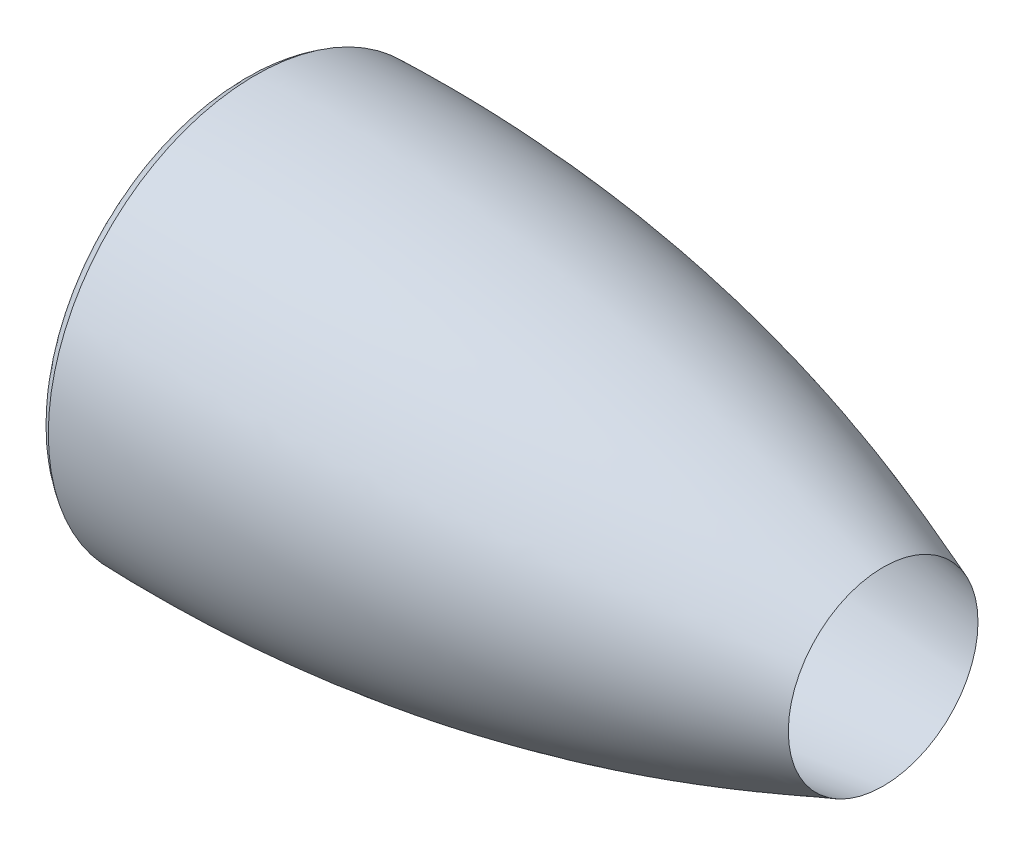
ISO-10303-21;
HEADER;
FILE_DESCRIPTION(('STEP AP214'),'2;1');
FILE_NAME('part.step','',(''),(''),'','','');
FILE_SCHEMA(('AUTOMOTIVE_DESIGN { 1 0 10303 214 1 1 1 1 }'));
ENDSEC;
DATA;
#1=APPLICATION_CONTEXT('core data for automotive mechanical design processes');
#2=APPLICATION_PROTOCOL_DEFINITION('international standard','automotive_design',2000,#1);
#3=PRODUCT_CONTEXT('',#1,'mechanical');
#4=PRODUCT('Part','Part','',(#3));
#5=PRODUCT_RELATED_PRODUCT_CATEGORY('part','',(#4));
#6=PRODUCT_DEFINITION_FORMATION('','',#4);
#7=PRODUCT_DEFINITION_CONTEXT('part definition',#1,'design');
#8=PRODUCT_DEFINITION('design','',#6,#7);
#9=PRODUCT_DEFINITION_SHAPE('','',#8);
#10=(LENGTH_UNIT() NAMED_UNIT(*) SI_UNIT(.MILLI.,.METRE.));
#11=(NAMED_UNIT(*) PLANE_ANGLE_UNIT() SI_UNIT($,.RADIAN.));
#12=(NAMED_UNIT(*) SI_UNIT($,.STERADIAN.) SOLID_ANGLE_UNIT());
#13=UNCERTAINTY_MEASURE_WITH_UNIT(LENGTH_MEASURE(1.E-05),#10,'distance_accuracy_value','');
#14=(GEOMETRIC_REPRESENTATION_CONTEXT(3) GLOBAL_UNCERTAINTY_ASSIGNED_CONTEXT((#13)) GLOBAL_UNIT_ASSIGNED_CONTEXT((#10,
#11,#12)) REPRESENTATION_CONTEXT('',''));
#15=CARTESIAN_POINT('',(0.,0.,0.));
#16=DIRECTION('',(0.,0.,1.));
#17=DIRECTION('',(1.,0.,0.));
#18=AXIS2_PLACEMENT_3D('',#15,#16,#17);
#19=CARTESIAN_POINT('',(-1.4699652629248,208.05036447345,0.));
#20=CARTESIAN_POINT('',(-2.27915844085005,207.555283103111,0.));
#21=CARTESIAN_POINT('',(-3.09149949924152,207.064026607034,0.));
#22=CARTESIAN_POINT('',(-4.68113892600378,206.038934525687,0.));
#23=CARTESIAN_POINT('',(-5.46173553687604,205.509106514081,0.));
#24=CARTESIAN_POINT('',(-6.98701099472926,204.405808131464,0.));
#25=CARTESIAN_POINT('',(-7.73174428130376,203.83240390801,0.));
#26=CARTESIAN_POINT('',(-9.17453767179157,202.628884586271,0.));
#27=CARTESIAN_POINT('',(-9.87270021432469,201.998893957402,0.));
#28=CARTESIAN_POINT('',(-11.2060190675517,200.662356134979,0.));
#29=CARTESIAN_POINT('',(-11.8413985159302,199.956080067854,0.));
#30=CARTESIAN_POINT('',(-12.7274048868419,198.815180413072,0.));
#31=CARTESIAN_POINT('',(-13.0117361627079,198.420324344508,0.));
#32=CARTESIAN_POINT('',(-13.5418638508033,197.615303302742,0.));
#33=CARTESIAN_POINT('',(-13.7891573816725,197.20334926151,0.));
#34=CARTESIAN_POINT('',(-14.2438974539579,196.358265645902,0.));
#35=CARTESIAN_POINT('',(-14.45135795747,195.925143491278,0.));
#36=CARTESIAN_POINT('',(-14.8212327067344,195.034960647717,0.));
#37=CARTESIAN_POINT('',(-14.984378621139,194.574945718655,0.));
#38=CARTESIAN_POINT('',(-15.3887628989499,193.182588769879,0.));
#39=CARTESIAN_POINT('',(-15.5479259643197,192.236293517212,0.));
#40=CARTESIAN_POINT('',(-15.6037014773061,190.786930948201,0.));
#41=CARTESIAN_POINT('',(-15.5910183823003,190.298049478634,0.));
#42=CARTESIAN_POINT('',(-15.5040811468896,189.33889164685,0.));
#43=CARTESIAN_POINT('',(-15.4301491253975,188.864985588631,0.));
#44=CARTESIAN_POINT('',(-15.2231675340036,187.928182269516,0.));
#45=CARTESIAN_POINT('',(-15.0901075330705,187.465286951075,0.));
#46=CARTESIAN_POINT('',(-14.7654627116333,186.55039473428,0.));
#47=CARTESIAN_POINT('',(-14.5754948564347,186.103570890243,0.));
#48=CARTESIAN_POINT('',(-14.14962129803,185.239438915026,0.));
#49=CARTESIAN_POINT('',(-13.9130880282748,184.820389138678,0.));
#50=CARTESIAN_POINT('',(-13.3970641342581,184.005985567388,0.));
#51=CARTESIAN_POINT('',(-13.1162754622452,183.609038802301,0.));
#52=CARTESIAN_POINT('',(-12.2243509943441,182.462867280215,0.));
#53=CARTESIAN_POINT('',(-11.5691673311279,181.762568923373,0.));
#54=CARTESIAN_POINT('',(-10.1700849090525,180.455445700678,0.));
#55=CARTESIAN_POINT('',(-9.42596444760471,179.848854428833,0.));
#56=CARTESIAN_POINT('',(-7.8700399873077,178.706985752052,0.));
#57=CARTESIAN_POINT('',(-7.06375993001646,178.175975612169,0.));
#58=CARTESIAN_POINT('',(-5.41954989898776,177.179484329693,0.));
#59=CARTESIAN_POINT('',(-4.57967693145507,176.712775612623,0.));
#60=CARTESIAN_POINT('',(-3.2995477475639,176.048778700703,0.));
#61=CARTESIAN_POINT('',(-2.86942357741075,175.833506802808,0.));
#62=CARTESIAN_POINT('',(-2.00313061097413,175.413691813336,0.));
#63=CARTESIAN_POINT('',(-1.56782237979263,175.207621276372,0.));
#64=CARTESIAN_POINT('',(-1.13338783760015,175.,0.));
#65=B_SPLINE_CURVE_WITH_KNOTS('',3,(#19,#20,#21,#22,#23,#24,#25,#26,#27,#28,#29,#30,#31,#32,#33,
#34,#35,#36,#37,#38,#39,#40,#41,#42,#43,#44,#45,#46,#47,#48,#49,#50,#51,#52,#53,#54,#55,#56,#57,
#58,#59,#60,#61,#62,#63,#64),.UNSPECIFIED.,.F.,.F.,(4,2,2,2,2,2,2,2,2,2,2,2,2,2,2,2,2,2,2,2,2,2,
4),(0.,0.0625000000000003,0.125000000000001,0.187500000000001,0.250000000000001,
0.312500000000002,0.343750000000002,0.375000000000002,0.406250000000002,0.437500000000002,
0.500000000000004,0.531250000000004,0.562500000000004,0.593750000000005,0.625000000000005,
0.656250000000005,0.687500000000005,0.750000000000004,0.812500000000003,0.875000000000002,
0.9375,0.96875,1.),.UNSPECIFIED.);
#66=CARTESIAN_POINT('',(0.,0.,0.));
#67=DIRECTION('',(-1.,0.,0.));
#68=AXIS1_PLACEMENT('',#66,#67);
#69=SURFACE_OF_REVOLUTION('',#65,#68);
#70=CARTESIAN_POINT('',(-1.13338783760016,0.,0.));
#71=DIRECTION('',(-1.,0.,0.));
#72=DIRECTION('',(0.,0.,1.));
#73=AXIS2_PLACEMENT_3D('',#70,#71,#72);
#74=CIRCLE('',#73,175.);
#75=CARTESIAN_POINT('',(-1.13338783760016,0.,175.));
#76=VERTEX_POINT('',#75);
#77=EDGE_CURVE('E10',#76,#76,#74,.T.);
#78=ORIENTED_EDGE('',*,*,#77,.F.);
#79=EDGE_LOOP('',(#78));
#80=FACE_BOUND('',#79,.T.);
#81=CARTESIAN_POINT('',(-1.4699652629248,0.,0.));
#82=DIRECTION('',(-1.,0.,0.));
#83=DIRECTION('',(0.,0.,1.));
#84=AXIS2_PLACEMENT_3D('',#81,#82,#83);
#85=CIRCLE('',#84,208.05036447345);
#86=CARTESIAN_POINT('',(-1.4699652629248,0.,208.05036447345));
#87=VERTEX_POINT('',#86);
#88=EDGE_CURVE('E63',#87,#87,#85,.T.);
#89=ORIENTED_EDGE('',*,*,#88,.T.);
#90=EDGE_LOOP('',(#89));
#91=FACE_BOUND('',#90,.T.);
#92=ADVANCED_FACE('F40',(#80,#91),#69,.T.);
#93=CARTESIAN_POINT('',(0.,0.,0.));
#94=DIRECTION('',(-1.,0.,0.));
#95=DIRECTION('',(0.,0.,1.));
#96=AXIS2_PLACEMENT_3D('',#93,#94,#95);
#97=CYLINDRICAL_SURFACE('',#96,175.);
#98=CARTESIAN_POINT('',(28.1385283724543,0.,0.));
#99=DIRECTION('',(-1.,0.,0.));
#100=DIRECTION('',(0.,0.,1.));
#101=AXIS2_PLACEMENT_3D('',#98,#99,#100);
#102=CIRCLE('',#101,175.);
#103=CARTESIAN_POINT('',(28.1385283724543,0.,175.));
#104=VERTEX_POINT('',#103);
#105=EDGE_CURVE('E47',#104,#104,#102,.T.);
#106=ORIENTED_EDGE('',*,*,#105,.F.);
#107=EDGE_LOOP('',(#106));
#108=FACE_BOUND('',#107,.T.);
#109=ORIENTED_EDGE('',*,*,#77,.T.);
#110=EDGE_LOOP('',(#109));
#111=FACE_BOUND('',#110,.T.);
#112=ADVANCED_FACE('F96',(#108,#111),#97,.F.);
#113=CARTESIAN_POINT('',(28.1385283724543,0.,0.));
#114=DIRECTION('',(1.,0.,0.));
#115=DIRECTION('',(0.,0.,-1.));
#116=AXIS2_PLACEMENT_3D('',#113,#114,#115);
#117=CONICAL_SURFACE('',#116,175.,1.12108520671515);
#118=CARTESIAN_POINT('',(32.9655166476797,0.,0.));
#119=DIRECTION('',(-1.,0.,0.));
#120=DIRECTION('',(0.,0.,1.));
#121=AXIS2_PLACEMENT_3D('',#118,#119,#120);
#122=CIRCLE('',#121,185.);
#123=CARTESIAN_POINT('',(32.9655166476797,0.,185.));
#124=VERTEX_POINT('',#123);
#125=EDGE_CURVE('E51',#124,#124,#122,.T.);
#126=ORIENTED_EDGE('',*,*,#125,.F.);
#127=EDGE_LOOP('',(#126));
#128=FACE_BOUND('',#127,.T.);
#129=ORIENTED_EDGE('',*,*,#105,.T.);
#130=EDGE_LOOP('',(#129));
#131=FACE_BOUND('',#130,.T.);
#132=ADVANCED_FACE('F93',(#128,#131),#117,.F.);
#133=CARTESIAN_POINT('',(0.,0.,0.));
#134=DIRECTION('',(-1.,0.,0.));
#135=DIRECTION('',(0.,0.,1.));
#136=AXIS2_PLACEMENT_3D('',#133,#134,#135);
#137=CYLINDRICAL_SURFACE('',#136,185.);
#138=CARTESIAN_POINT('',(54.4389912653308,0.,0.));
#139=DIRECTION('',(-1.,0.,0.));
#140=DIRECTION('',(0.,0.,1.));
#141=AXIS2_PLACEMENT_3D('',#138,#139,#140);
#142=CIRCLE('',#141,185.);
#143=CARTESIAN_POINT('',(54.4389912653308,0.,185.));
#144=VERTEX_POINT('',#143);
#145=EDGE_CURVE('E55',#144,#144,#142,.T.);
#146=ORIENTED_EDGE('',*,*,#145,.F.);
#147=EDGE_LOOP('',(#146));
#148=FACE_BOUND('',#147,.T.);
#149=ORIENTED_EDGE('',*,*,#125,.T.);
#150=EDGE_LOOP('',(#149));
#151=FACE_BOUND('',#150,.T.);
#152=ADVANCED_FACE('F89',(#148,#151),#137,.F.);
#153=CARTESIAN_POINT('',(54.4389912653308,0.,0.));
#154=DIRECTION('',(-1.,0.,0.));
#155=DIRECTION('',(0.,0.,1.));
#156=AXIS2_PLACEMENT_3D('',#153,#154,#155);
#157=CONICAL_SURFACE('',#156,185.,0.154888406140732);
#158=CARTESIAN_POINT('',(629.093281934513,0.,0.));
#159=DIRECTION('',(-1.,0.,0.));
#160=DIRECTION('',(0.,0.,1.));
#161=AXIS2_PLACEMENT_3D('',#158,#159,#160);
#162=CIRCLE('',#161,95.2740415389665);
#163=CARTESIAN_POINT('',(629.093281934513,0.,95.2740415389665));
#164=VERTEX_POINT('',#163);
#165=EDGE_CURVE('E60',#164,#164,#162,.T.);
#166=ORIENTED_EDGE('',*,*,#165,.F.);
#167=EDGE_LOOP('',(#166));
#168=FACE_BOUND('',#167,.T.);
#169=ORIENTED_EDGE('',*,*,#145,.T.);
#170=EDGE_LOOP('',(#169));
#171=FACE_BOUND('',#170,.T.);
#172=ADVANCED_FACE('F82',(#168,#171),#157,.F.);
#173=CARTESIAN_POINT('',(629.093281934513,95.2740415389665,0.));
#174=CARTESIAN_POINT('',(616.477891252097,99.9131613755693,0.));
#175=CARTESIAN_POINT('',(600.708652899076,105.712061171323,0.));
#176=CARTESIAN_POINT('',(584.939414546056,111.510960967076,0.));
#177=CARTESIAN_POINT('',(578.631719204848,113.830520885378,0.));
#178=CARTESIAN_POINT('',(575.474543155226,114.980635109532,0.));
#179=CARTESIAN_POINT('',(565.992611837468,118.400766597182,0.));
#180=CARTESIAN_POINT('',(546.987649895072,125.121675674768,0.));
#181=CARTESIAN_POINT('',(527.85862987821,131.482315544566,0.));
#182=CARTESIAN_POINT('',(508.645870600343,137.599773522715,0.));
#183=CARTESIAN_POINT('',(502.227660737125,139.598395207331,0.));
#184=CARTESIAN_POINT('',(489.363152367398,143.514068124099,0.));
#185=CARTESIAN_POINT('',(482.91608960792,145.431325814156,0.));
#186=CARTESIAN_POINT('',(450.63436623516,154.805514819687,0.));
#187=CARTESIAN_POINT('',(424.643358299525,161.63154697861,0.));
#188=CARTESIAN_POINT('',(385.405596715937,170.849210361033,0.));
#189=CARTESIAN_POINT('',(372.284467297625,173.751531530996,0.));
#190=CARTESIAN_POINT('',(345.957982265187,179.213775978781,0.));
#191=CARTESIAN_POINT('',(332.749071531065,181.774206537374,0.));
#192=CARTESIAN_POINT('',(293.060908370017,188.927945480464,0.));
#193=CARTESIAN_POINT('',(266.501125501609,192.998060868807,0.));
#194=CARTESIAN_POINT('',(226.510545733962,198.058859807103,0.));
#195=CARTESIAN_POINT('',(213.155201482581,199.571729843257,0.));
#196=CARTESIAN_POINT('',(193.084533569419,201.580459239922,0.));
#197=CARTESIAN_POINT('',(186.387530596471,202.206626814305,0.));
#198=CARTESIAN_POINT('',(172.993764723008,203.371172345671,0.));
#199=CARTESIAN_POINT('',(166.29544041956,203.909716269992,0.));
#200=CARTESIAN_POINT('',(132.796650123184,206.384946198275,0.));
#201=CARTESIAN_POINT('',(105.974679140314,207.669204001794,0.));
#202=CARTESIAN_POINT('',(65.708028840958,208.573372063795,0.));
#203=CARTESIAN_POINT('',(52.2801961670736,208.704383454848,0.));
#204=CARTESIAN_POINT('',(32.1301102099402,208.647970459133,0.));
#205=CARTESIAN_POINT('',(22.0529829705545,208.556530705226,0.));
#206=CARTESIAN_POINT('',(11.9727454199138,208.370728908827,0.));
#207=CARTESIAN_POINT('',(5.25189764444692,208.225945458672,0.));
#208=CARTESIAN_POINT('',(1.89105606470387,208.140881602759,0.));
#209=CARTESIAN_POINT('',(-1.46996526292466,208.05036447345,0.));
#210=B_SPLINE_CURVE_WITH_KNOTS('',3,(#173,#174,#175,#176,#177,#178,#179,#180,#181,#182,#183,
#184,#185,#186,#187,#188,#189,#190,#191,#192,#193,#194,#195,#196,#197,#198,#199,#200,#201,#202,
#203,#204,#205,#206,#207,#208,#209),.UNSPECIFIED.,.F.,.F.,(4,1,2,2,1,2,2,2,2,2,2,2,2,2,2,2,2,1,
2,4),(0.,0.0625000000000011,0.078125000000001,0.0937500000000009,0.125000000000001,
0.187500000000001,0.218750000000001,0.250000000000001,0.375,0.4375,0.5,0.625,0.6875,0.71875,
0.75,0.875,0.9375,0.96875,0.984375,1.),.UNSPECIFIED.);
#211=CARTESIAN_POINT('',(0.,0.,0.));
#212=DIRECTION('',(-1.,0.,0.));
#213=AXIS1_PLACEMENT('',#211,#212);
#214=SURFACE_OF_REVOLUTION('',#210,#213);
#215=ORIENTED_EDGE('',*,*,#88,.F.);
#216=EDGE_LOOP('',(#215));
#217=FACE_BOUND('',#216,.T.);
#218=ORIENTED_EDGE('',*,*,#165,.T.);
#219=EDGE_LOOP('',(#218));
#220=FACE_BOUND('',#219,.T.);
#221=ADVANCED_FACE('F78',(#217,#220),#214,.T.);
#222=CLOSED_SHELL('',(#92,#112,#132,#152,#172,#221));
#223=CARTESIAN_POINT('',(0.,203.088139821324,0.));
#224=CARTESIAN_POINT('',(-21.1869788583722,190.12550146414,0.));
#225=CARTESIAN_POINT('',(0.,180.,0.));
#226=B_SPLINE_CURVE_WITH_KNOTS('',2,(#223,#224,#225),.UNSPECIFIED.,.F.,.F.,(3,3),(0.,1.),.UNSPECIFIED.);
#227=CARTESIAN_POINT('',(0.,0.,0.));
#228=DIRECTION('',(-1.,0.,0.));
#229=AXIS1_PLACEMENT('',#227,#228);
#230=SURFACE_OF_REVOLUTION('',#226,#229);
#231=CARTESIAN_POINT('',(0.,0.,0.));
#232=DIRECTION('',(-1.,0.,0.));
#233=DIRECTION('',(0.,0.,1.));
#234=AXIS2_PLACEMENT_3D('',#231,#232,#233);
#235=CIRCLE('',#234,180.);
#236=CARTESIAN_POINT('',(0.,0.,180.));
#237=VERTEX_POINT('',#236);
#238=EDGE_CURVE('E239',#237,#237,#235,.T.);
#239=ORIENTED_EDGE('',*,*,#238,.T.);
#240=EDGE_LOOP('',(#239));
#241=FACE_BOUND('',#240,.T.);
#242=CARTESIAN_POINT('',(0.,0.,0.));
#243=DIRECTION('',(-1.,0.,0.));
#244=DIRECTION('',(0.,0.,1.));
#245=AXIS2_PLACEMENT_3D('',#242,#243,#244);
#246=CIRCLE('',#245,203.088139821324);
#247=CARTESIAN_POINT('',(0.,0.,203.088139821324));
#248=VERTEX_POINT('',#247);
#249=EDGE_CURVE('E66',#248,#248,#246,.T.);
#250=ORIENTED_EDGE('',*,*,#249,.F.);
#251=EDGE_LOOP('',(#250));
#252=FACE_BOUND('',#251,.T.);
#253=ADVANCED_FACE('F84',(#241,#252),#230,.F.);
#254=CARTESIAN_POINT('',(580.,108.,0.));
#255=CARTESIAN_POINT('',(299.48870867785,211.153800680741,0.));
#256=CARTESIAN_POINT('',(0.,203.088139821324,0.));
#257=B_SPLINE_CURVE_WITH_KNOTS('',2,(#254,#255,#256),.UNSPECIFIED.,.F.,.F.,(3,3),(0.,1.),.UNSPECIFIED.);
#258=CARTESIAN_POINT('',(0.,0.,0.));
#259=DIRECTION('',(-1.,0.,0.));
#260=AXIS1_PLACEMENT('',#258,#259);
#261=SURFACE_OF_REVOLUTION('',#257,#260);
#262=ORIENTED_EDGE('',*,*,#249,.T.);
#263=EDGE_LOOP('',(#262));
#264=FACE_BOUND('',#263,.T.);
#265=CARTESIAN_POINT('',(580.,0.,0.));
#266=DIRECTION('',(-1.,0.,0.));
#267=DIRECTION('',(0.,0.,1.));
#268=AXIS2_PLACEMENT_3D('',#265,#266,#267);
#269=CIRCLE('',#268,108.);
#270=CARTESIAN_POINT('',(580.,0.,108.));
#271=VERTEX_POINT('',#270);
#272=EDGE_CURVE('E253',#271,#271,#269,.T.);
#273=ORIENTED_EDGE('',*,*,#272,.F.);
#274=EDGE_LOOP('',(#273));
#275=FACE_BOUND('',#274,.T.);
#276=ADVANCED_FACE('F157',(#264,#275),#261,.F.);
#277=CARTESIAN_POINT('',(54.8269882752253,0.,0.));
#278=DIRECTION('',(-1.,0.,0.));
#279=DIRECTION('',(0.,0.,1.));
#280=AXIS2_PLACEMENT_3D('',#277,#278,#279);
#281=CONICAL_SURFACE('',#280,190.,0.154888406140732);
#282=ORIENTED_EDGE('',*,*,#272,.T.);
#283=EDGE_LOOP('',(#282));
#284=FACE_BOUND('',#283,.T.);
#285=CARTESIAN_POINT('',(54.8269882752253,0.,0.));
#286=DIRECTION('',(-1.,0.,0.));
#287=DIRECTION('',(0.,0.,1.));
#288=AXIS2_PLACEMENT_3D('',#285,#286,#287);
#289=CIRCLE('',#288,190.);
#290=CARTESIAN_POINT('',(54.8269882752253,0.,190.));
#291=VERTEX_POINT('',#290);
#292=EDGE_CURVE('E250',#291,#291,#289,.T.);
#293=ORIENTED_EDGE('',*,*,#292,.F.);
#294=EDGE_LOOP('',(#293));
#295=FACE_BOUND('',#294,.T.);
#296=ADVANCED_FACE('F168',(#284,#295),#281,.T.);
#297=CARTESIAN_POINT('',(0.,0.,0.));
#298=DIRECTION('',(-1.,0.,0.));
#299=DIRECTION('',(0.,0.,1.));
#300=AXIS2_PLACEMENT_3D('',#297,#298,#299);
#301=CYLINDRICAL_SURFACE('',#300,190.);
#302=ORIENTED_EDGE('',*,*,#292,.T.);
#303=EDGE_LOOP('',(#302));
#304=FACE_BOUND('',#303,.T.);
#305=CARTESIAN_POINT('',(29.8269882752253,0.,0.));
#306=DIRECTION('',(-1.,0.,0.));
#307=DIRECTION('',(0.,0.,1.));
#308=AXIS2_PLACEMENT_3D('',#305,#306,#307);
#309=CIRCLE('',#308,190.);
#310=CARTESIAN_POINT('',(29.8269882752253,0.,190.));
#311=VERTEX_POINT('',#310);
#312=EDGE_CURVE('E247',#311,#311,#309,.T.);
#313=ORIENTED_EDGE('',*,*,#312,.F.);
#314=EDGE_LOOP('',(#313));
#315=FACE_BOUND('',#314,.T.);
#316=ADVANCED_FACE('F178',(#304,#315),#301,.T.);
#317=CARTESIAN_POINT('',(25.,0.,0.));
#318=DIRECTION('',(1.,0.,0.));
#319=DIRECTION('',(0.,0.,-1.));
#320=AXIS2_PLACEMENT_3D('',#317,#318,#319);
#321=CONICAL_SURFACE('',#320,180.,1.12108520671515);
#322=ORIENTED_EDGE('',*,*,#312,.T.);
#323=EDGE_LOOP('',(#322));
#324=FACE_BOUND('',#323,.T.);
#325=CARTESIAN_POINT('',(25.,0.,0.));
#326=DIRECTION('',(-1.,0.,0.));
#327=DIRECTION('',(0.,0.,1.));
#328=AXIS2_PLACEMENT_3D('',#325,#326,#327);
#329=CIRCLE('',#328,180.);
#330=CARTESIAN_POINT('',(25.,0.,180.));
#331=VERTEX_POINT('',#330);
#332=EDGE_CURVE('E245',#331,#331,#329,.T.);
#333=ORIENTED_EDGE('',*,*,#332,.F.);
#334=EDGE_LOOP('',(#333));
#335=FACE_BOUND('',#334,.T.);
#336=ADVANCED_FACE('F189',(#324,#335),#321,.T.);
#337=CARTESIAN_POINT('',(0.,0.,0.));
#338=DIRECTION('',(-1.,0.,0.));
#339=DIRECTION('',(0.,0.,1.));
#340=AXIS2_PLACEMENT_3D('',#337,#338,#339);
#341=CYLINDRICAL_SURFACE('',#340,180.);
#342=ORIENTED_EDGE('',*,*,#332,.T.);
#343=EDGE_LOOP('',(#342));
#344=FACE_BOUND('',#343,.T.);
#345=ORIENTED_EDGE('',*,*,#238,.F.);
#346=EDGE_LOOP('',(#345));
#347=FACE_BOUND('',#346,.T.);
#348=ADVANCED_FACE('F200',(#344,#347),#341,.T.);
#349=CLOSED_SHELL('',(#253,#276,#296,#316,#336,#348));
#350=ORIENTED_CLOSED_SHELL('',*,#349,.T.);
#351=BREP_WITH_VOIDS('B2',#222,(#350));
#352=ADVANCED_BREP_SHAPE_REPRESENTATION('',(#18,#351),#14);
#353=SHAPE_DEFINITION_REPRESENTATION(#9,#352);
ENDSEC;
END-ISO-10303-21;
